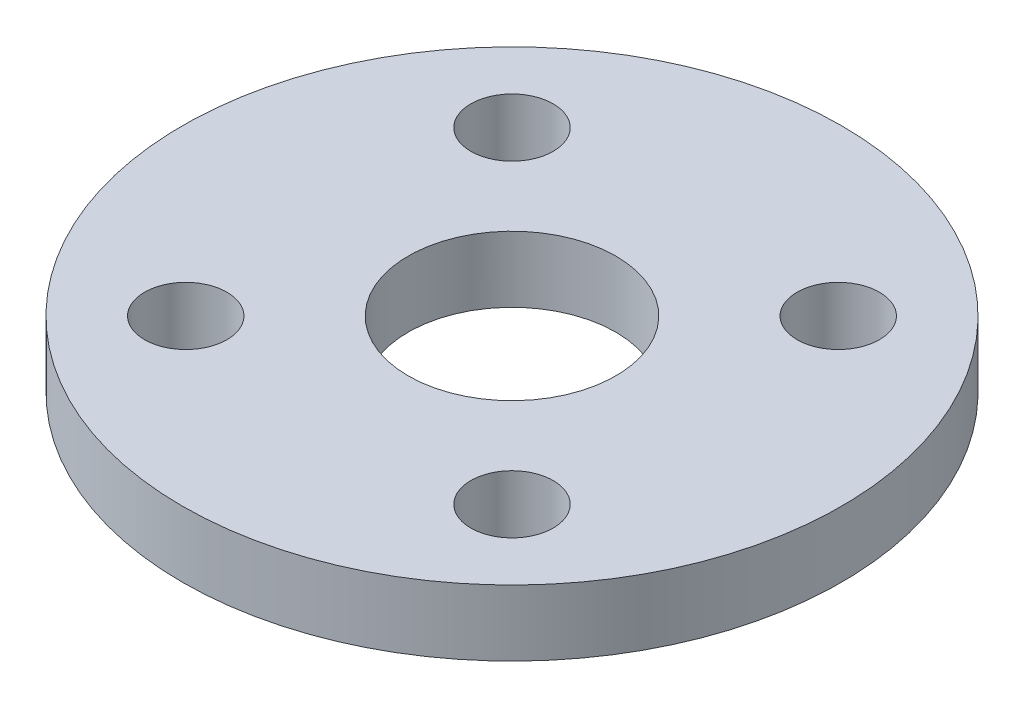
ISO-10303-21;
HEADER;
FILE_DESCRIPTION(('STEP AP214'),'2;1');
FILE_NAME('part.step','',(''),(''),'','','');
FILE_SCHEMA(('AUTOMOTIVE_DESIGN { 1 0 10303 214 1 1 1 1 }'));
ENDSEC;
DATA;
#1=APPLICATION_CONTEXT('core data for automotive mechanical design processes');
#2=APPLICATION_PROTOCOL_DEFINITION('international standard','automotive_design',2000,#1);
#3=PRODUCT_CONTEXT('',#1,'mechanical');
#4=PRODUCT('Part','Part','',(#3));
#5=PRODUCT_RELATED_PRODUCT_CATEGORY('part','',(#4));
#6=PRODUCT_DEFINITION_FORMATION('','',#4);
#7=PRODUCT_DEFINITION_CONTEXT('part definition',#1,'design');
#8=PRODUCT_DEFINITION('design','',#6,#7);
#9=PRODUCT_DEFINITION_SHAPE('','',#8);
#10=(LENGTH_UNIT() NAMED_UNIT(*) SI_UNIT(.MILLI.,.METRE.));
#11=(NAMED_UNIT(*) PLANE_ANGLE_UNIT() SI_UNIT($,.RADIAN.));
#12=(NAMED_UNIT(*) SI_UNIT($,.STERADIAN.) SOLID_ANGLE_UNIT());
#13=UNCERTAINTY_MEASURE_WITH_UNIT(LENGTH_MEASURE(1.E-05),#10,'distance_accuracy_value','');
#14=(GEOMETRIC_REPRESENTATION_CONTEXT(3) GLOBAL_UNCERTAINTY_ASSIGNED_CONTEXT((#13)) GLOBAL_UNIT_ASSIGNED_CONTEXT((#10,
#11,#12)) REPRESENTATION_CONTEXT('',''));
#15=CARTESIAN_POINT('',(0.,0.,0.));
#16=DIRECTION('',(0.,0.,1.));
#17=DIRECTION('',(1.,0.,0.));
#18=AXIS2_PLACEMENT_3D('',#15,#16,#17);
#19=CARTESIAN_POINT('',(10.,2.,0.));
#20=DIRECTION('',(0.,1.,0.));
#21=DIRECTION('',(0.,0.,1.));
#22=AXIS2_PLACEMENT_3D('',#19,#20,#21);
#23=PLANE('',#22);
#24=CARTESIAN_POINT('',(-4.94974746830583,2.,-4.94974746830583));
#25=DIRECTION('',(0.,1.,0.));
#26=DIRECTION('',(0.,0.,1.));
#27=AXIS2_PLACEMENT_3D('',#24,#25,#26);
#28=CIRCLE('',#27,1.24999999999999);
#29=CARTESIAN_POINT('',(-4.94974746830583,2.,-3.69974746830585));
#30=VERTEX_POINT('',#29);
#31=EDGE_CURVE('E68',#30,#30,#28,.T.);
#32=ORIENTED_EDGE('',*,*,#31,.F.);
#33=EDGE_LOOP('',(#32));
#34=FACE_BOUND('',#33,.T.);
#35=CARTESIAN_POINT('',(4.94974746830583,2.,-4.94974746830583));
#36=DIRECTION('',(0.,1.,0.));
#37=DIRECTION('',(0.,0.,1.));
#38=AXIS2_PLACEMENT_3D('',#35,#36,#37);
#39=CIRCLE('',#38,1.24999999999999);
#40=CARTESIAN_POINT('',(4.94974746830583,2.,-3.69974746830585));
#41=VERTEX_POINT('',#40);
#42=EDGE_CURVE('E62',#41,#41,#39,.T.);
#43=ORIENTED_EDGE('',*,*,#42,.F.);
#44=EDGE_LOOP('',(#43));
#45=FACE_BOUND('',#44,.T.);
#46=CARTESIAN_POINT('',(4.94974746830583,2.,4.94974746830583));
#47=DIRECTION('',(0.,1.,0.));
#48=DIRECTION('',(0.,0.,1.));
#49=AXIS2_PLACEMENT_3D('',#46,#47,#48);
#50=CIRCLE('',#49,1.24999999999999);
#51=CARTESIAN_POINT('',(4.94974746830583,2.,6.19974746830582));
#52=VERTEX_POINT('',#51);
#53=EDGE_CURVE('E56',#52,#52,#50,.T.);
#54=ORIENTED_EDGE('',*,*,#53,.F.);
#55=EDGE_LOOP('',(#54));
#56=FACE_BOUND('',#55,.T.);
#57=CARTESIAN_POINT('',(-4.94974746830583,2.,4.94974746830583));
#58=DIRECTION('',(0.,1.,0.));
#59=DIRECTION('',(0.,0.,1.));
#60=AXIS2_PLACEMENT_3D('',#57,#58,#59);
#61=CIRCLE('',#60,1.24999999999999);
#62=CARTESIAN_POINT('',(-4.94974746830583,2.,6.19974746830582));
#63=VERTEX_POINT('',#62);
#64=EDGE_CURVE('E48',#63,#63,#61,.T.);
#65=ORIENTED_EDGE('',*,*,#64,.F.);
#66=EDGE_LOOP('',(#65));
#67=FACE_BOUND('',#66,.T.);
#68=CARTESIAN_POINT('',(0.,2.,0.));
#69=DIRECTION('',(0.,-1.,0.));
#70=DIRECTION('',(0.,0.,-1.));
#71=AXIS2_PLACEMENT_3D('',#68,#69,#70);
#72=CIRCLE('',#71,10.);
#73=CARTESIAN_POINT('',(0.,2.,-10.));
#74=VERTEX_POINT('',#73);
#75=EDGE_CURVE('E10',#74,#74,#72,.T.);
#76=ORIENTED_EDGE('',*,*,#75,.F.);
#77=EDGE_LOOP('',(#76));
#78=FACE_BOUND('',#77,.T.);
#79=CARTESIAN_POINT('',(0.,2.,0.));
#80=DIRECTION('',(0.,1.,0.));
#81=DIRECTION('',(0.,0.,1.));
#82=AXIS2_PLACEMENT_3D('',#79,#80,#81);
#83=CIRCLE('',#82,3.15);
#84=CARTESIAN_POINT('',(0.,2.,3.15));
#85=VERTEX_POINT('',#84);
#86=EDGE_CURVE('E71',#85,#85,#83,.F.);
#87=ORIENTED_EDGE('',*,*,#86,.T.);
#88=EDGE_LOOP('',(#87));
#89=FACE_BOUND('',#88,.T.);
#90=ADVANCED_FACE('F33',(#34,#45,#56,#67,#78,#89),#23,.T.);
#91=CARTESIAN_POINT('',(0.,2.,0.));
#92=DIRECTION('',(0.,-1.,0.));
#93=DIRECTION('',(0.,0.,-1.));
#94=AXIS2_PLACEMENT_3D('',#91,#92,#93);
#95=CYLINDRICAL_SURFACE('',#94,10.);
#96=ORIENTED_EDGE('',*,*,#75,.T.);
#97=EDGE_LOOP('',(#96));
#98=FACE_BOUND('',#97,.T.);
#99=CARTESIAN_POINT('',(0.,0.,0.));
#100=DIRECTION('',(0.,-1.,0.));
#101=DIRECTION('',(0.,0.,-1.));
#102=AXIS2_PLACEMENT_3D('',#99,#100,#101);
#103=CIRCLE('',#102,10.);
#104=CARTESIAN_POINT('',(0.,0.,-10.));
#105=VERTEX_POINT('',#104);
#106=EDGE_CURVE('E40',#105,#105,#103,.T.);
#107=ORIENTED_EDGE('',*,*,#106,.F.);
#108=EDGE_LOOP('',(#107));
#109=FACE_BOUND('',#108,.T.);
#110=ADVANCED_FACE('F35',(#98,#109),#95,.T.);
#111=CARTESIAN_POINT('',(0.,0.,0.));
#112=DIRECTION('',(0.,-1.,0.));
#113=DIRECTION('',(0.,0.,-1.));
#114=AXIS2_PLACEMENT_3D('',#111,#112,#113);
#115=PLANE('',#114);
#116=CARTESIAN_POINT('',(-4.94974746830583,0.,-4.94974746830583));
#117=DIRECTION('',(0.,1.,0.));
#118=DIRECTION('',(0.,0.,1.));
#119=AXIS2_PLACEMENT_3D('',#116,#117,#118);
#120=CIRCLE('',#119,1.24999999999999);
#121=CARTESIAN_POINT('',(-4.94974746830583,0.,-3.69974746830585));
#122=VERTEX_POINT('',#121);
#123=EDGE_CURVE('E65',#122,#122,#120,.T.);
#124=ORIENTED_EDGE('',*,*,#123,.T.);
#125=EDGE_LOOP('',(#124));
#126=FACE_BOUND('',#125,.T.);
#127=CARTESIAN_POINT('',(4.94974746830583,0.,-4.94974746830583));
#128=DIRECTION('',(0.,1.,0.));
#129=DIRECTION('',(0.,0.,1.));
#130=AXIS2_PLACEMENT_3D('',#127,#128,#129);
#131=CIRCLE('',#130,1.24999999999999);
#132=CARTESIAN_POINT('',(4.94974746830583,0.,-3.69974746830585));
#133=VERTEX_POINT('',#132);
#134=EDGE_CURVE('E59',#133,#133,#131,.T.);
#135=ORIENTED_EDGE('',*,*,#134,.T.);
#136=EDGE_LOOP('',(#135));
#137=FACE_BOUND('',#136,.T.);
#138=CARTESIAN_POINT('',(4.94974746830583,0.,4.94974746830583));
#139=DIRECTION('',(0.,1.,0.));
#140=DIRECTION('',(0.,0.,1.));
#141=AXIS2_PLACEMENT_3D('',#138,#139,#140);
#142=CIRCLE('',#141,1.24999999999999);
#143=CARTESIAN_POINT('',(4.94974746830583,0.,6.19974746830582));
#144=VERTEX_POINT('',#143);
#145=EDGE_CURVE('E53',#144,#144,#142,.T.);
#146=ORIENTED_EDGE('',*,*,#145,.T.);
#147=EDGE_LOOP('',(#146));
#148=FACE_BOUND('',#147,.T.);
#149=CARTESIAN_POINT('',(-4.94974746830583,0.,4.94974746830583));
#150=DIRECTION('',(0.,1.,0.));
#151=DIRECTION('',(0.,0.,1.));
#152=AXIS2_PLACEMENT_3D('',#149,#150,#151);
#153=CIRCLE('',#152,1.24999999999999);
#154=CARTESIAN_POINT('',(-4.94974746830583,0.,6.19974746830582));
#155=VERTEX_POINT('',#154);
#156=EDGE_CURVE('E44',#155,#155,#153,.T.);
#157=ORIENTED_EDGE('',*,*,#156,.T.);
#158=EDGE_LOOP('',(#157));
#159=FACE_BOUND('',#158,.T.);
#160=ORIENTED_EDGE('',*,*,#106,.T.);
#161=EDGE_LOOP('',(#160));
#162=FACE_BOUND('',#161,.T.);
#163=CARTESIAN_POINT('',(0.,0.,0.));
#164=DIRECTION('',(0.,-1.,0.));
#165=DIRECTION('',(0.,0.,-1.));
#166=AXIS2_PLACEMENT_3D('',#163,#164,#165);
#167=CIRCLE('',#166,3.15);
#168=CARTESIAN_POINT('',(0.,0.,-3.15));
#169=VERTEX_POINT('',#168);
#170=EDGE_CURVE('E74',#169,#169,#167,.T.);
#171=ORIENTED_EDGE('',*,*,#170,.F.);
#172=EDGE_LOOP('',(#171));
#173=FACE_BOUND('',#172,.T.);
#174=ADVANCED_FACE('F81',(#126,#137,#148,#159,#162,#173),#115,.T.);
#175=CARTESIAN_POINT('',(-4.94974746830583,2.,4.94974746830583));
#176=DIRECTION('',(0.,1.,0.));
#177=DIRECTION('',(0.,0.,1.));
#178=AXIS2_PLACEMENT_3D('',#175,#176,#177);
#179=CYLINDRICAL_SURFACE('',#178,1.24999999999999);
#180=ORIENTED_EDGE('',*,*,#156,.F.);
#181=EDGE_LOOP('',(#180));
#182=FACE_BOUND('',#181,.T.);
#183=ORIENTED_EDGE('',*,*,#64,.T.);
#184=EDGE_LOOP('',(#183));
#185=FACE_BOUND('',#184,.T.);
#186=ADVANCED_FACE('F83',(#182,#185),#179,.F.);
#187=CARTESIAN_POINT('',(4.94974746830583,2.,4.94974746830583));
#188=DIRECTION('',(0.,1.,0.));
#189=DIRECTION('',(0.,0.,1.));
#190=AXIS2_PLACEMENT_3D('',#187,#188,#189);
#191=CYLINDRICAL_SURFACE('',#190,1.24999999999999);
#192=ORIENTED_EDGE('',*,*,#145,.F.);
#193=EDGE_LOOP('',(#192));
#194=FACE_BOUND('',#193,.T.);
#195=ORIENTED_EDGE('',*,*,#53,.T.);
#196=EDGE_LOOP('',(#195));
#197=FACE_BOUND('',#196,.T.);
#198=ADVANCED_FACE('F90',(#194,#197),#191,.F.);
#199=CARTESIAN_POINT('',(4.94974746830583,2.,-4.94974746830583));
#200=DIRECTION('',(0.,1.,0.));
#201=DIRECTION('',(0.,0.,1.));
#202=AXIS2_PLACEMENT_3D('',#199,#200,#201);
#203=CYLINDRICAL_SURFACE('',#202,1.24999999999999);
#204=ORIENTED_EDGE('',*,*,#134,.F.);
#205=EDGE_LOOP('',(#204));
#206=FACE_BOUND('',#205,.T.);
#207=ORIENTED_EDGE('',*,*,#42,.T.);
#208=EDGE_LOOP('',(#207));
#209=FACE_BOUND('',#208,.T.);
#210=ADVANCED_FACE('F114',(#206,#209),#203,.F.);
#211=CARTESIAN_POINT('',(-4.94974746830583,2.,-4.94974746830583));
#212=DIRECTION('',(0.,1.,0.));
#213=DIRECTION('',(0.,0.,1.));
#214=AXIS2_PLACEMENT_3D('',#211,#212,#213);
#215=CYLINDRICAL_SURFACE('',#214,1.24999999999999);
#216=ORIENTED_EDGE('',*,*,#123,.F.);
#217=EDGE_LOOP('',(#216));
#218=FACE_BOUND('',#217,.T.);
#219=ORIENTED_EDGE('',*,*,#31,.T.);
#220=EDGE_LOOP('',(#219));
#221=FACE_BOUND('',#220,.T.);
#222=ADVANCED_FACE('F109',(#218,#221),#215,.F.);
#223=CARTESIAN_POINT('',(0.,14.7279220613579,0.));
#224=DIRECTION('',(0.,-1.,0.));
#225=DIRECTION('',(0.,0.,-1.));
#226=AXIS2_PLACEMENT_3D('',#223,#224,#225);
#227=CYLINDRICAL_SURFACE('',#226,3.15);
#228=ORIENTED_EDGE('',*,*,#170,.T.);
#229=EDGE_LOOP('',(#228));
#230=FACE_BOUND('',#229,.T.);
#231=ORIENTED_EDGE('',*,*,#86,.F.);
#232=EDGE_LOOP('',(#231));
#233=FACE_BOUND('',#232,.T.);
#234=ADVANCED_FACE('F78',(#230,#233),#227,.F.);
#235=CLOSED_SHELL('',(#90,#110,#174,#186,#198,#210,#222,#234));
#236=MANIFOLD_SOLID_BREP('B2',#235);
#237=ADVANCED_BREP_SHAPE_REPRESENTATION('',(#18,#236),#14);
#238=SHAPE_DEFINITION_REPRESENTATION(#9,#237);
ENDSEC;
END-ISO-10303-21;
